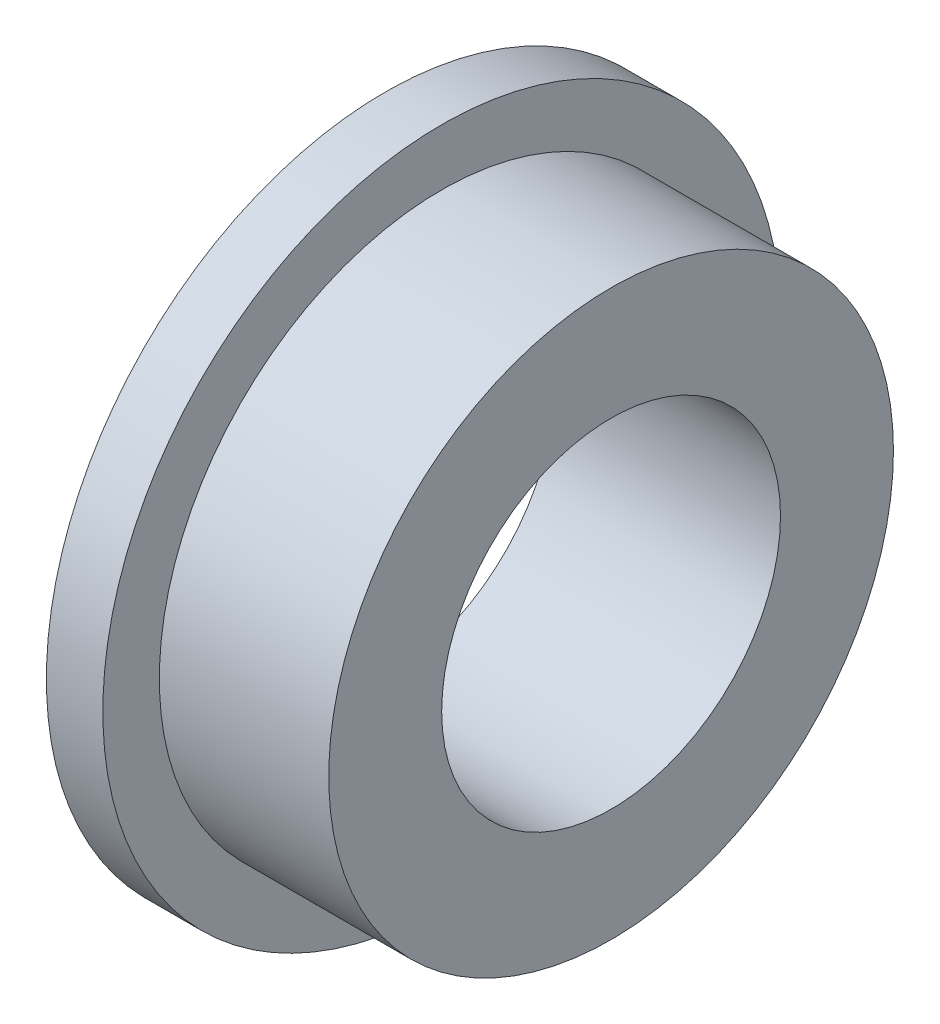
ISO-10303-21;
HEADER;
FILE_DESCRIPTION(('STEP AP214'),'2;1');
FILE_NAME('part.step','',(''),(''),'','','');
FILE_SCHEMA(('AUTOMOTIVE_DESIGN { 1 0 10303 214 1 1 1 1 }'));
ENDSEC;
DATA;
#1=APPLICATION_CONTEXT('core data for automotive mechanical design processes');
#2=APPLICATION_PROTOCOL_DEFINITION('international standard','automotive_design',2000,#1);
#3=PRODUCT_CONTEXT('',#1,'mechanical');
#4=PRODUCT('Part','Part','',(#3));
#5=PRODUCT_RELATED_PRODUCT_CATEGORY('part','',(#4));
#6=PRODUCT_DEFINITION_FORMATION('','',#4);
#7=PRODUCT_DEFINITION_CONTEXT('part definition',#1,'design');
#8=PRODUCT_DEFINITION('design','',#6,#7);
#9=PRODUCT_DEFINITION_SHAPE('','',#8);
#10=(LENGTH_UNIT() NAMED_UNIT(*) SI_UNIT(.MILLI.,.METRE.));
#11=(NAMED_UNIT(*) PLANE_ANGLE_UNIT() SI_UNIT($,.RADIAN.));
#12=(NAMED_UNIT(*) SI_UNIT($,.STERADIAN.) SOLID_ANGLE_UNIT());
#13=UNCERTAINTY_MEASURE_WITH_UNIT(LENGTH_MEASURE(1.E-05),#10,'distance_accuracy_value','');
#14=(GEOMETRIC_REPRESENTATION_CONTEXT(3) GLOBAL_UNCERTAINTY_ASSIGNED_CONTEXT((#13)) GLOBAL_UNIT_ASSIGNED_CONTEXT((#10,
#11,#12)) REPRESENTATION_CONTEXT('',''));
#15=CARTESIAN_POINT('',(0.,0.,0.));
#16=DIRECTION('',(0.,0.,1.));
#17=DIRECTION('',(1.,0.,0.));
#18=AXIS2_PLACEMENT_3D('',#15,#16,#17);
#19=CARTESIAN_POINT('',(1.,0.,0.));
#20=DIRECTION('',(1.,0.,0.));
#21=DIRECTION('',(0.,0.,-1.));
#22=AXIS2_PLACEMENT_3D('',#19,#20,#21);
#23=PLANE('',#22);
#24=CARTESIAN_POINT('',(1.,0.,0.));
#25=DIRECTION('',(1.,0.,0.));
#26=DIRECTION('',(0.,0.,-1.));
#27=AXIS2_PLACEMENT_3D('',#24,#25,#26);
#28=CIRCLE('',#27,6.);
#29=CARTESIAN_POINT('',(1.,0.,-6.));
#30=VERTEX_POINT('',#29);
#31=EDGE_CURVE('E10',#30,#30,#28,.T.);
#32=ORIENTED_EDGE('',*,*,#31,.T.);
#33=EDGE_LOOP('',(#32));
#34=FACE_BOUND('',#33,.T.);
#35=CARTESIAN_POINT('',(1.,0.,0.));
#36=DIRECTION('',(1.,0.,0.));
#37=DIRECTION('',(0.,0.,-1.));
#38=AXIS2_PLACEMENT_3D('',#35,#36,#37);
#39=CIRCLE('',#38,5.);
#40=CARTESIAN_POINT('',(1.,0.,-5.));
#41=VERTEX_POINT('',#40);
#42=EDGE_CURVE('E46',#41,#41,#39,.T.);
#43=ORIENTED_EDGE('',*,*,#42,.F.);
#44=EDGE_LOOP('',(#43));
#45=FACE_BOUND('',#44,.T.);
#46=ADVANCED_FACE('F30',(#34,#45),#23,.T.);
#47=CARTESIAN_POINT('',(0.,0.,0.));
#48=DIRECTION('',(1.,0.,0.));
#49=DIRECTION('',(0.,0.,-1.));
#50=AXIS2_PLACEMENT_3D('',#47,#48,#49);
#51=PLANE('',#50);
#52=CARTESIAN_POINT('',(0.,0.,0.));
#53=DIRECTION('',(1.,0.,0.));
#54=DIRECTION('',(0.,0.,-1.));
#55=AXIS2_PLACEMENT_3D('',#52,#53,#54);
#56=CIRCLE('',#55,6.);
#57=CARTESIAN_POINT('',(0.,0.,-6.));
#58=VERTEX_POINT('',#57);
#59=EDGE_CURVE('E34',#58,#58,#56,.T.);
#60=ORIENTED_EDGE('',*,*,#59,.F.);
#61=EDGE_LOOP('',(#60));
#62=FACE_BOUND('',#61,.T.);
#63=CARTESIAN_POINT('',(0.,0.,0.));
#64=DIRECTION('',(1.,0.,0.));
#65=DIRECTION('',(0.,0.,-1.));
#66=AXIS2_PLACEMENT_3D('',#63,#64,#65);
#67=CIRCLE('',#66,3.);
#68=CARTESIAN_POINT('',(0.,0.,-3.));
#69=VERTEX_POINT('',#68);
#70=EDGE_CURVE('E41',#69,#69,#67,.T.);
#71=ORIENTED_EDGE('',*,*,#70,.T.);
#72=EDGE_LOOP('',(#71));
#73=FACE_BOUND('',#72,.T.);
#74=ADVANCED_FACE('F71',(#62,#73),#51,.F.);
#75=CARTESIAN_POINT('',(1.,0.,0.));
#76=DIRECTION('',(-1.,0.,0.));
#77=DIRECTION('',(0.,0.,1.));
#78=AXIS2_PLACEMENT_3D('',#75,#76,#77);
#79=CYLINDRICAL_SURFACE('',#78,6.);
#80=ORIENTED_EDGE('',*,*,#31,.F.);
#81=EDGE_LOOP('',(#80));
#82=FACE_BOUND('',#81,.T.);
#83=ORIENTED_EDGE('',*,*,#59,.T.);
#84=EDGE_LOOP('',(#83));
#85=FACE_BOUND('',#84,.T.);
#86=ADVANCED_FACE('F32',(#82,#85),#79,.T.);
#87=CARTESIAN_POINT('',(1.,0.,0.));
#88=DIRECTION('',(-1.,0.,0.));
#89=DIRECTION('',(0.,0.,1.));
#90=AXIS2_PLACEMENT_3D('',#87,#88,#89);
#91=CYLINDRICAL_SURFACE('',#90,3.);
#92=ORIENTED_EDGE('',*,*,#70,.F.);
#93=EDGE_LOOP('',(#92));
#94=FACE_BOUND('',#93,.T.);
#95=CARTESIAN_POINT('',(4.,0.,0.));
#96=DIRECTION('',(1.,0.,0.));
#97=DIRECTION('',(0.,0.,-1.));
#98=AXIS2_PLACEMENT_3D('',#95,#96,#97);
#99=CIRCLE('',#98,3.);
#100=CARTESIAN_POINT('',(4.,0.,-3.));
#101=VERTEX_POINT('',#100);
#102=EDGE_CURVE('E49',#101,#101,#99,.T.);
#103=ORIENTED_EDGE('',*,*,#102,.T.);
#104=EDGE_LOOP('',(#103));
#105=FACE_BOUND('',#104,.T.);
#106=ADVANCED_FACE('F55',(#94,#105),#91,.F.);
#107=CARTESIAN_POINT('',(4.,0.,0.));
#108=DIRECTION('',(1.,0.,0.));
#109=DIRECTION('',(0.,0.,-1.));
#110=AXIS2_PLACEMENT_3D('',#107,#108,#109);
#111=PLANE('',#110);
#112=CARTESIAN_POINT('',(4.,0.,0.));
#113=DIRECTION('',(1.,0.,0.));
#114=DIRECTION('',(0.,0.,-1.));
#115=AXIS2_PLACEMENT_3D('',#112,#113,#114);
#116=CIRCLE('',#115,5.);
#117=CARTESIAN_POINT('',(4.,0.,-5.));
#118=VERTEX_POINT('',#117);
#119=EDGE_CURVE('E45',#118,#118,#116,.T.);
#120=ORIENTED_EDGE('',*,*,#119,.T.);
#121=EDGE_LOOP('',(#120));
#122=FACE_BOUND('',#121,.T.);
#123=ORIENTED_EDGE('',*,*,#102,.F.);
#124=EDGE_LOOP('',(#123));
#125=FACE_BOUND('',#124,.T.);
#126=ADVANCED_FACE('F57',(#122,#125),#111,.T.);
#127=CARTESIAN_POINT('',(4.,0.,0.));
#128=DIRECTION('',(-1.,0.,0.));
#129=DIRECTION('',(0.,0.,1.));
#130=AXIS2_PLACEMENT_3D('',#127,#128,#129);
#131=CYLINDRICAL_SURFACE('',#130,5.);
#132=ORIENTED_EDGE('',*,*,#119,.F.);
#133=EDGE_LOOP('',(#132));
#134=FACE_BOUND('',#133,.T.);
#135=ORIENTED_EDGE('',*,*,#42,.T.);
#136=EDGE_LOOP('',(#135));
#137=FACE_BOUND('',#136,.T.);
#138=ADVANCED_FACE('F59',(#134,#137),#131,.T.);
#139=CLOSED_SHELL('',(#46,#74,#86,#106,#126,#138));
#140=MANIFOLD_SOLID_BREP('B2',#139);
#141=ADVANCED_BREP_SHAPE_REPRESENTATION('',(#18,#140),#14);
#142=SHAPE_DEFINITION_REPRESENTATION(#9,#141);
ENDSEC;
END-ISO-10303-21;
